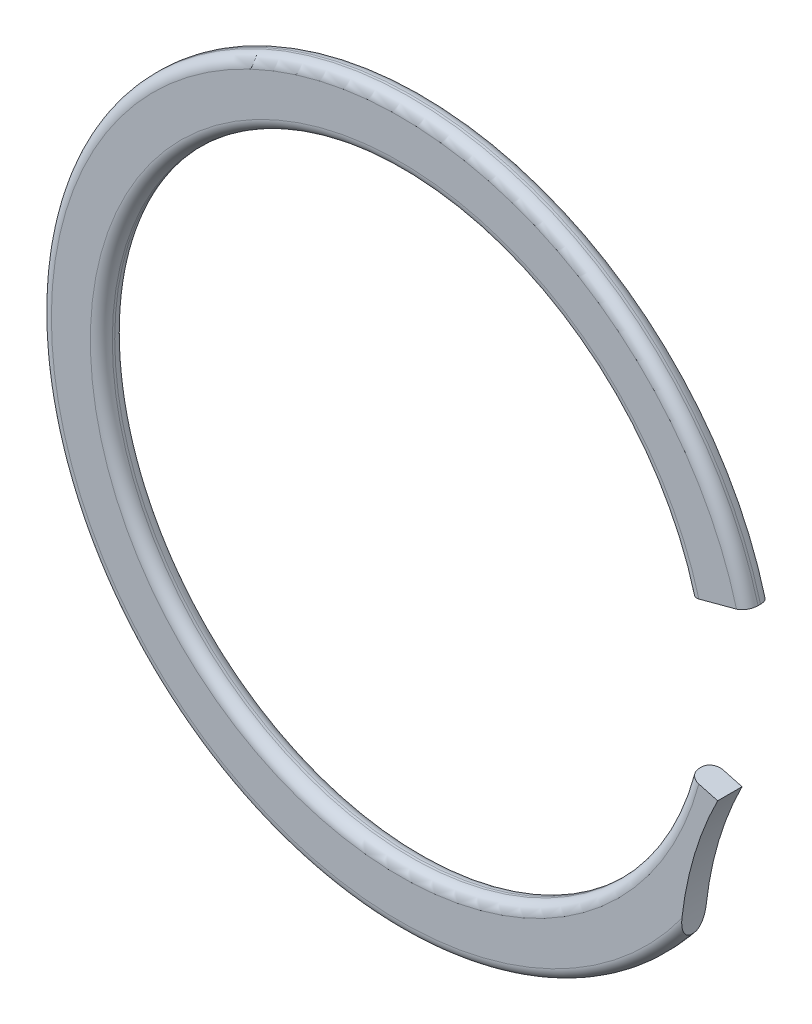
ISO-10303-21;
HEADER;
FILE_DESCRIPTION(('STEP AP214'),'2;1');
FILE_NAME('part.step','',(''),(''),'','','');
FILE_SCHEMA(('AUTOMOTIVE_DESIGN { 1 0 10303 214 1 1 1 1 }'));
ENDSEC;
DATA;
#1=APPLICATION_CONTEXT('core data for automotive mechanical design processes');
#2=APPLICATION_PROTOCOL_DEFINITION('international standard','automotive_design',2000,#1);
#3=PRODUCT_CONTEXT('',#1,'mechanical');
#4=PRODUCT('Part','Part','',(#3));
#5=PRODUCT_RELATED_PRODUCT_CATEGORY('part','',(#4));
#6=PRODUCT_DEFINITION_FORMATION('','',#4);
#7=PRODUCT_DEFINITION_CONTEXT('part definition',#1,'design');
#8=PRODUCT_DEFINITION('design','',#6,#7);
#9=PRODUCT_DEFINITION_SHAPE('','',#8);
#10=(LENGTH_UNIT() NAMED_UNIT(*) SI_UNIT(.MILLI.,.METRE.));
#11=(NAMED_UNIT(*) PLANE_ANGLE_UNIT() SI_UNIT($,.RADIAN.));
#12=(NAMED_UNIT(*) SI_UNIT($,.STERADIAN.) SOLID_ANGLE_UNIT());
#13=UNCERTAINTY_MEASURE_WITH_UNIT(LENGTH_MEASURE(1.E-05),#10,'distance_accuracy_value','');
#14=(GEOMETRIC_REPRESENTATION_CONTEXT(3) GLOBAL_UNCERTAINTY_ASSIGNED_CONTEXT((#13)) GLOBAL_UNIT_ASSIGNED_CONTEXT((#10,
#11,#12)) REPRESENTATION_CONTEXT('',''));
#15=CARTESIAN_POINT('',(0.,0.,0.));
#16=DIRECTION('',(0.,0.,1.));
#17=DIRECTION('',(1.,0.,0.));
#18=AXIS2_PLACEMENT_3D('',#15,#16,#17);
#19=CARTESIAN_POINT('',(0.,0.,0.2286));
#20=DIRECTION('',(0.,0.,-1.));
#21=DIRECTION('',(-1.,0.,0.));
#22=AXIS2_PLACEMENT_3D('',#19,#20,#21);
#23=CYLINDRICAL_SURFACE('',#22,5.6007);
#24=DIRECTION('',(0.,0.,-1.));
#25=VECTOR('',#24,1.);
#26=CARTESIAN_POINT('',(5.40986077529718,-1.44956782590569,0.2286));
#27=LINE('',#26,#25);
#28=CARTESIAN_POINT('',(5.40986077529718,-1.44956782590569,0.02286));
#29=VERTEX_POINT('',#28);
#30=CARTESIAN_POINT('',(5.40986077529718,-1.44956782590569,-0.02286));
#31=VERTEX_POINT('',#30);
#32=EDGE_CURVE('E134',#29,#31,#27,.T.);
#33=ORIENTED_EDGE('',*,*,#32,.T.);
#34=CARTESIAN_POINT('',(0.,0.,-0.02286));
#35=DIRECTION('',(0.,0.,1.));
#36=DIRECTION('',(1.,0.,0.));
#37=AXIS2_PLACEMENT_3D('',#34,#35,#36);
#38=CIRCLE('',#37,5.6007);
#39=CARTESIAN_POINT('',(5.40986077529718,1.44956782590569,-0.02286));
#40=VERTEX_POINT('',#39);
#41=EDGE_CURVE('E160',#31,#40,#38,.F.);
#42=ORIENTED_EDGE('',*,*,#41,.T.);
#43=DIRECTION('',(0.,0.,-1.));
#44=VECTOR('',#43,1.);
#45=CARTESIAN_POINT('',(5.40986077529718,1.44956782590569,0.2286));
#46=LINE('',#45,#44);
#47=CARTESIAN_POINT('',(5.40986077529718,1.44956782590569,0.02286));
#48=VERTEX_POINT('',#47);
#49=EDGE_CURVE('E155',#48,#40,#46,.T.);
#50=ORIENTED_EDGE('',*,*,#49,.F.);
#51=CARTESIAN_POINT('',(0.,0.,0.02286));
#52=DIRECTION('',(0.,0.,1.));
#53=DIRECTION('',(1.,0.,0.));
#54=AXIS2_PLACEMENT_3D('',#51,#52,#53);
#55=CIRCLE('',#54,5.6007);
#56=EDGE_CURVE('E158',#48,#29,#55,.T.);
#57=ORIENTED_EDGE('',*,*,#56,.T.);
#58=EDGE_LOOP('',(#33,#42,#50,#57));
#59=FACE_BOUND('',#58,.T.);
#60=ADVANCED_FACE('F37',(#59),#23,.F.);
#61=CARTESIAN_POINT('',(5.40986077529718,1.44956782590569,0.2286));
#62=DIRECTION('',(-0.258819045102522,0.965925826289068,0.));
#63=DIRECTION('',(-0.965925826289068,-0.258819045102522,0.));
#64=AXIS2_PLACEMENT_3D('',#61,#62,#63);
#65=PLANE('',#64);
#66=ORIENTED_EDGE('',*,*,#49,.T.);
#67=CARTESIAN_POINT('',(5.6085903547979,1.50281725624509,-0.02286));
#68=DIRECTION('',(-0.258819045102522,0.965925826289068,0.));
#69=DIRECTION('',(-0.965925826289068,-0.258819045102522,0.));
#70=AXIS2_PLACEMENT_3D('',#67,#68,#69);
#71=CIRCLE('',#70,0.20574);
#72=CARTESIAN_POINT('',(5.6085903547979,1.50281725624508,-0.2286));
#73=VERTEX_POINT('',#72);
#74=EDGE_CURVE('E169',#40,#73,#71,.F.);
#75=ORIENTED_EDGE('',*,*,#74,.T.);
#76=DIRECTION('',(0.965925826289068,0.258819045102522,0.));
#77=VECTOR('',#76,1.);
#78=CARTESIAN_POINT('',(5.40986077529718,1.44956782590569,-0.2286));
#79=LINE('',#78,#77);
#80=CARTESIAN_POINT('',(6.31518441524488,1.69214856411848,-0.2286));
#81=VERTEX_POINT('',#80);
#82=EDGE_CURVE('E145',#73,#81,#79,.T.);
#83=ORIENTED_EDGE('',*,*,#82,.T.);
#84=CARTESIAN_POINT('',(6.31518441524487,1.69214856411848,-0.02286));
#85=DIRECTION('',(-0.258819045102522,0.965925826289068,0.));
#86=DIRECTION('',(-0.965925826289068,-0.258819045102522,0.));
#87=AXIS2_PLACEMENT_3D('',#84,#85,#86);
#88=CIRCLE('',#87,0.20574);
#89=CARTESIAN_POINT('',(6.51391399474559,1.74539799445787,-0.02286));
#90=VERTEX_POINT('',#89);
#91=EDGE_CURVE('E165',#81,#90,#88,.F.);
#92=ORIENTED_EDGE('',*,*,#91,.T.);
#93=DIRECTION('',(0.,0.,-1.));
#94=VECTOR('',#93,1.);
#95=CARTESIAN_POINT('',(6.51391399474559,1.74539799445787,0.2286));
#96=LINE('',#95,#94);
#97=CARTESIAN_POINT('',(6.51391399474559,1.74539799445787,0.02286));
#98=VERTEX_POINT('',#97);
#99=EDGE_CURVE('E152',#98,#90,#96,.T.);
#100=ORIENTED_EDGE('',*,*,#99,.F.);
#101=CARTESIAN_POINT('',(6.31518441524487,1.69214856411848,0.02286));
#102=DIRECTION('',(-0.258819045102522,0.965925826289068,0.));
#103=DIRECTION('',(-0.965925826289068,-0.258819045102522,0.));
#104=AXIS2_PLACEMENT_3D('',#101,#102,#103);
#105=CIRCLE('',#104,0.20574);
#106=CARTESIAN_POINT('',(6.31518441524488,1.69214856411848,0.2286));
#107=VERTEX_POINT('',#106);
#108=EDGE_CURVE('E163',#98,#107,#105,.F.);
#109=ORIENTED_EDGE('',*,*,#108,.T.);
#110=DIRECTION('',(0.965925826289068,0.258819045102522,0.));
#111=VECTOR('',#110,1.);
#112=CARTESIAN_POINT('',(5.40986077529718,1.44956782590569,0.2286));
#113=LINE('',#112,#111);
#114=CARTESIAN_POINT('',(5.6085903547979,1.50281725624508,0.2286));
#115=VERTEX_POINT('',#114);
#116=EDGE_CURVE('E123',#115,#107,#113,.T.);
#117=ORIENTED_EDGE('',*,*,#116,.F.);
#118=CARTESIAN_POINT('',(5.6085903547979,1.50281725624509,0.02286));
#119=DIRECTION('',(-0.258819045102522,0.965925826289068,0.));
#120=DIRECTION('',(-0.965925826289068,-0.258819045102522,0.));
#121=AXIS2_PLACEMENT_3D('',#118,#119,#120);
#122=CIRCLE('',#121,0.20574);
#123=EDGE_CURVE('E167',#115,#48,#122,.F.);
#124=ORIENTED_EDGE('',*,*,#123,.T.);
#125=EDGE_LOOP('',(#66,#75,#83,#92,#100,#109,#117,#124));
#126=FACE_BOUND('',#125,.T.);
#127=ADVANCED_FACE('F197',(#126),#65,.F.);
#128=CARTESIAN_POINT('',(0.,0.,0.2286));
#129=DIRECTION('',(0.,0.,-1.));
#130=DIRECTION('',(-1.,0.,0.));
#131=AXIS2_PLACEMENT_3D('',#128,#129,#130);
#132=CYLINDRICAL_SURFACE('',#131,6.7437);
#133=ORIENTED_EDGE('',*,*,#99,.T.);
#134=CARTESIAN_POINT('',(0.,0.,-0.02286));
#135=DIRECTION('',(0.,0.,1.));
#136=DIRECTION('',(1.,0.,0.));
#137=AXIS2_PLACEMENT_3D('',#134,#135,#136);
#138=CIRCLE('',#137,6.7437);
#139=CARTESIAN_POINT('',(5.25870710178336,-4.22178745410677,-0.02286));
#140=VERTEX_POINT('',#139);
#141=EDGE_CURVE('E183',#90,#140,#138,.T.);
#142=ORIENTED_EDGE('',*,*,#141,.T.);
#143=DIRECTION('',(0.,0.,-1.));
#144=VECTOR('',#143,1.);
#145=CARTESIAN_POINT('',(5.25870710178336,-4.22178745410677,0.2286));
#146=LINE('',#145,#144);
#147=CARTESIAN_POINT('',(5.25870710178336,-4.22178745410677,0.02286));
#148=VERTEX_POINT('',#147);
#149=EDGE_CURVE('E133',#148,#140,#146,.T.);
#150=ORIENTED_EDGE('',*,*,#149,.F.);
#151=CARTESIAN_POINT('',(0.,0.,0.02286));
#152=DIRECTION('',(0.,0.,1.));
#153=DIRECTION('',(1.,0.,0.));
#154=AXIS2_PLACEMENT_3D('',#151,#152,#153);
#155=CIRCLE('',#154,6.7437);
#156=EDGE_CURVE('E181',#148,#98,#155,.F.);
#157=ORIENTED_EDGE('',*,*,#156,.T.);
#158=EDGE_LOOP('',(#133,#142,#150,#157));
#159=FACE_BOUND('',#158,.T.);
#160=ADVANCED_FACE('F192',(#159),#132,.T.);
#161=CARTESIAN_POINT('',(11.8481979332859,-4.58107563446412,0.2286));
#162=DIRECTION('',(0.,0.,-1.));
#163=DIRECTION('',(-1.,0.,0.));
#164=AXIS2_PLACEMENT_3D('',#161,#162,#163);
#165=CYLINDRICAL_SURFACE('',#164,6.59927855261474);
#166=ORIENTED_EDGE('',*,*,#149,.T.);
#167=CARTESIAN_POINT('',(5.25870710178336,-4.22178745410677,-0.02286));
#168=CARTESIAN_POINT('',(5.25870618484912,-4.22181377440628,-0.0311346804732611));
#169=CARTESIAN_POINT('',(5.25875361373559,-4.22093385432323,-0.0393759772816312));
#170=CARTESIAN_POINT('',(5.25893628270641,-4.21760247096861,-0.0554344022414807));
#171=CARTESIAN_POINT('',(5.25907044912222,-4.21517022756176,-0.0632554668394935));
#172=CARTESIAN_POINT('',(5.25941727513635,-4.20897923960508,-0.0782947041500948));
#173=CARTESIAN_POINT('',(5.25962956958604,-4.20522666942315,-0.0855154929339836));
#174=CARTESIAN_POINT('',(5.26012354056371,-4.19666455570426,-0.0993167484833779));
#175=CARTESIAN_POINT('',(5.26040544065308,-4.19185161190302,-0.105895054779456));
#176=CARTESIAN_POINT('',(5.26119839347793,-4.17861039126786,-0.121729278597547));
#177=CARTESIAN_POINT('',(5.26175110839779,-4.16963072561344,-0.130520060605449));
#178=CARTESIAN_POINT('',(5.26297775608299,-4.15044094474612,-0.146605313635845));
#179=CARTESIAN_POINT('',(5.26365191916114,-4.14022850406845,-0.153896884318738));
#180=CARTESIAN_POINT('',(5.26559180669542,-4.11194375522221,-0.171592430486733));
#181=CARTESIAN_POINT('',(5.26695280686477,-4.09316047225724,-0.180842054025715));
#182=CARTESIAN_POINT('',(5.26993811858312,-4.05442713788926,-0.196512369633285));
#183=CARTESIAN_POINT('',(5.27156376283052,-4.03447152609617,-0.202918097853559));
#184=CARTESIAN_POINT('',(5.27576428741668,-3.98575541699964,-0.215543311421398));
#185=CARTESIAN_POINT('',(5.27845645902292,-3.95671220957192,-0.220629344297652));
#186=CARTESIAN_POINT('',(5.28278794787484,-3.9131839459249,-0.225515665971397));
#187=CARTESIAN_POINT('',(5.28426653409714,-3.8988057181605,-0.22668864776739));
#188=CARTESIAN_POINT('',(5.28732034988349,-3.87004054702135,-0.228228847491245));
#189=CARTESIAN_POINT('',(5.28889541073569,-3.85565366009843,-0.228597432971679));
#190=CARTESIAN_POINT('',(5.29051835660908,-3.84126756162576,-0.228600000009827));
#191=B_SPLINE_CURVE_WITH_KNOTS('',3,(#167,#168,#169,#170,#171,#172,#173,#174,#175,#176,#177,
#178,#179,#180,#181,#182,#183,#184,#185,#186,#187,#188,#189,#190),.UNSPECIFIED.,.F.,.F.,(4,2,2,
2,2,2,2,2,2,2,2,4),(0.,0.0247243751463407,0.0491484155819667,0.0734597252622984,
0.0978501582393234,0.13537172357385,0.172965208093986,0.235555997965558,0.298472330446135,
0.386955377023208,0.43044549825703,0.473861624236137),.UNSPECIFIED.);
#192=CARTESIAN_POINT('',(5.2905183566094,-3.84126756162324,-0.2286));
#193=VERTEX_POINT('',#192);
#194=EDGE_CURVE('E11',#140,#193,#191,.T.);
#195=ORIENTED_EDGE('',*,*,#194,.T.);
#196=CARTESIAN_POINT('',(11.8481979332859,-4.58107563446412,-0.2286));
#197=DIRECTION('',(0.,0.,-1.));
#198=DIRECTION('',(1.,0.,0.));
#199=AXIS2_PLACEMENT_3D('',#196,#197,#198);
#200=CIRCLE('',#199,6.59927855261474);
#201=CARTESIAN_POINT('',(5.96188738502138,-1.59748291018178,-0.2286));
#202=VERTEX_POINT('',#201);
#203=EDGE_CURVE('E129',#193,#202,#200,.T.);
#204=ORIENTED_EDGE('',*,*,#203,.T.);
#205=DIRECTION('',(0.,0.,-1.));
#206=VECTOR('',#205,1.);
#207=CARTESIAN_POINT('',(5.96188738502138,-1.59748291018178,0.2286));
#208=LINE('',#207,#206);
#209=CARTESIAN_POINT('',(5.96188738502138,-1.59748291018178,0.2286));
#210=VERTEX_POINT('',#209);
#211=EDGE_CURVE('E126',#210,#202,#208,.T.);
#212=ORIENTED_EDGE('',*,*,#211,.F.);
#213=CARTESIAN_POINT('',(11.8481979332859,-4.58107563446412,0.2286));
#214=DIRECTION('',(0.,0.,-1.));
#215=DIRECTION('',(1.,0.,0.));
#216=AXIS2_PLACEMENT_3D('',#213,#214,#215);
#217=CIRCLE('',#216,6.59927855261474);
#218=CARTESIAN_POINT('',(5.2905183566094,-3.84126756162324,0.2286));
#219=VERTEX_POINT('',#218);
#220=EDGE_CURVE('E113',#219,#210,#217,.T.);
#221=ORIENTED_EDGE('',*,*,#220,.F.);
#222=CARTESIAN_POINT('',(5.2905183566094,-3.84126756162324,0.2286));
#223=CARTESIAN_POINT('',(5.28858068143016,-3.85843842874321,0.228592672466069));
#224=CARTESIAN_POINT('',(5.28671039018272,-3.87562676262966,0.228069816018459));
#225=CARTESIAN_POINT('',(5.28310511847852,-3.91000797623636,0.225856331987943));
#226=CARTESIAN_POINT('',(5.28137068683543,-3.9272006185604,0.224161215111085));
#227=CARTESIAN_POINT('',(5.27803959153466,-3.96156173092725,0.21944590782354));
#228=CARTESIAN_POINT('',(5.27644412659451,-3.97872893324474,0.216415338584235));
#229=CARTESIAN_POINT('',(5.27341768380362,-4.01271657704711,0.208828911910879));
#230=CARTESIAN_POINT('',(5.27198641821535,-4.02953758138375,0.204275779145824));
#231=CARTESIAN_POINT('',(5.26964173614769,-4.0583632665669,0.194766942021903));
#232=CARTESIAN_POINT('',(5.26868964550739,-4.07049685497902,0.190213905622912));
#233=CARTESIAN_POINT('',(5.26688730171751,-4.09428034547199,0.179961762904873));
#234=CARTESIAN_POINT('',(5.26603700047403,-4.10593047426638,0.174263201265855));
#235=CARTESIAN_POINT('',(5.26443980081566,-4.12859757658371,0.161482558972795));
#236=CARTESIAN_POINT('',(5.26369384999356,-4.13960827552167,0.15438905120647));
#237=CARTESIAN_POINT('',(5.26232878107568,-4.16046498039599,0.138638376323013));
#238=CARTESIAN_POINT('',(5.26170940133258,-4.17031337086536,0.129984505989414));
#239=CARTESIAN_POINT('',(5.2608099259451,-4.18505670663943,0.114273563573802));
#240=CARTESIAN_POINT('',(5.26048693413885,-4.19047935703411,0.107716728632742));
#241=CARTESIAN_POINT('',(5.25991218433513,-4.20029693488472,0.093855295067759));
#242=CARTESIAN_POINT('',(5.25966043649585,-4.20469171576843,0.0865505900122581));
#243=CARTESIAN_POINT('',(5.25923628187348,-4.21219056479722,0.0711732419786442));
#244=CARTESIAN_POINT('',(5.25906495148464,-4.21527707145056,0.0630918340560122));
#245=CARTESIAN_POINT('',(5.25881819471666,-4.21974824764553,0.0464834525758514));
#246=CARTESIAN_POINT('',(5.25874238833521,-4.22113965967301,0.0379583858753324));
#247=CARTESIAN_POINT('',(5.25871030817721,-4.22172886212149,0.027220408252027));
#248=CARTESIAN_POINT('',(5.2587070538979,-4.22178868979613,0.0250396430635047));
#249=CARTESIAN_POINT('',(5.25870710178336,-4.22178745410677,0.0228600000000001));
#250=B_SPLINE_CURVE_WITH_KNOTS('',3,(#222,#223,#224,#225,#226,#227,#228,#229,#230,#231,#232,
#233,#234,#235,#236,#237,#238,#239,#240,#241,#242,#243,#244,#245,#246,#247,#248,#249),
.UNSPECIFIED.,.F.,.F.,(4,2,2,2,2,2,2,2,2,2,2,2,2,4),(0.,0.0518467962248723,0.103893252741262,
0.156351539335899,0.20871644833783,0.247652674759219,0.286570431196202,0.325821376397392,
0.364990342543509,0.390458801818303,0.415930890635279,0.441734832822795,0.46743579738377,
0.473977177215381),.UNSPECIFIED.);
#251=EDGE_CURVE('E51',#219,#148,#250,.T.);
#252=ORIENTED_EDGE('',*,*,#251,.T.);
#253=EDGE_LOOP('',(#166,#195,#204,#212,#221,#252));
#254=FACE_BOUND('',#253,.T.);
#255=ADVANCED_FACE('F127',(#254),#165,.F.);
#256=CARTESIAN_POINT('',(5.40986077529718,-1.44956782590569,0.2286));
#257=DIRECTION('',(-0.258819045102523,-0.965925826289068,0.));
#258=DIRECTION('',(0.965925826289068,-0.258819045102524,0.));
#259=AXIS2_PLACEMENT_3D('',#256,#257,#258);
#260=PLANE('',#259);
#261=DIRECTION('',(-0.965925826289068,0.258819045102523,0.));
#262=VECTOR('',#261,1.);
#263=CARTESIAN_POINT('',(5.40986077529718,-1.44956782590569,-0.2286));
#264=LINE('',#263,#262);
#265=CARTESIAN_POINT('',(5.6085903547979,-1.50281725624508,-0.2286));
#266=VERTEX_POINT('',#265);
#267=EDGE_CURVE('E149',#202,#266,#264,.T.);
#268=ORIENTED_EDGE('',*,*,#267,.T.);
#269=CARTESIAN_POINT('',(5.6085903547979,-1.5028172562451,-0.02286));
#270=DIRECTION('',(-0.258819045102523,-0.965925826289068,0.));
#271=DIRECTION('',(0.965925826289068,-0.258819045102524,0.));
#272=AXIS2_PLACEMENT_3D('',#269,#270,#271);
#273=CIRCLE('',#272,0.20574);
#274=EDGE_CURVE('E176',#266,#31,#273,.F.);
#275=ORIENTED_EDGE('',*,*,#274,.T.);
#276=ORIENTED_EDGE('',*,*,#32,.F.);
#277=CARTESIAN_POINT('',(5.6085903547979,-1.5028172562451,0.02286));
#278=DIRECTION('',(-0.258819045102523,-0.965925826289068,0.));
#279=DIRECTION('',(0.965925826289068,-0.258819045102524,0.));
#280=AXIS2_PLACEMENT_3D('',#277,#278,#279);
#281=CIRCLE('',#280,0.20574);
#282=CARTESIAN_POINT('',(5.6085903547979,-1.50281725624508,0.2286));
#283=VERTEX_POINT('',#282);
#284=EDGE_CURVE('E139',#29,#283,#281,.F.);
#285=ORIENTED_EDGE('',*,*,#284,.T.);
#286=DIRECTION('',(-0.965925826289068,0.258819045102523,0.));
#287=VECTOR('',#286,1.);
#288=CARTESIAN_POINT('',(5.40986077529718,-1.44956782590569,0.2286));
#289=LINE('',#288,#287);
#290=EDGE_CURVE('E118',#210,#283,#289,.T.);
#291=ORIENTED_EDGE('',*,*,#290,.F.);
#292=ORIENTED_EDGE('',*,*,#211,.T.);
#293=EDGE_LOOP('',(#268,#275,#276,#285,#291,#292));
#294=FACE_BOUND('',#293,.T.);
#295=ADVANCED_FACE('F136',(#294),#260,.F.);
#296=CARTESIAN_POINT('',(0.,0.,0.2286));
#297=DIRECTION('',(0.,0.,1.));
#298=DIRECTION('',(1.,0.,0.));
#299=AXIS2_PLACEMENT_3D('',#296,#297,#298);
#300=PLANE('',#299);
#301=ORIENTED_EDGE('',*,*,#290,.T.);
#302=CARTESIAN_POINT('',(0.,0.,0.2286));
#303=DIRECTION('',(0.,0.,1.));
#304=DIRECTION('',(1.,0.,0.));
#305=AXIS2_PLACEMENT_3D('',#302,#303,#304);
#306=CIRCLE('',#305,5.80644);
#307=EDGE_CURVE('E179',#283,#115,#306,.F.);
#308=ORIENTED_EDGE('',*,*,#307,.T.);
#309=ORIENTED_EDGE('',*,*,#116,.T.);
#310=CARTESIAN_POINT('',(0.,0.,0.2286));
#311=DIRECTION('',(0.,0.,1.));
#312=DIRECTION('',(1.,0.,0.));
#313=AXIS2_PLACEMENT_3D('',#310,#311,#312);
#314=CIRCLE('',#313,6.53796);
#315=EDGE_CURVE('E122',#107,#219,#314,.T.);
#316=ORIENTED_EDGE('',*,*,#315,.T.);
#317=ORIENTED_EDGE('',*,*,#220,.T.);
#318=EDGE_LOOP('',(#301,#308,#309,#316,#317));
#319=FACE_BOUND('',#318,.T.);
#320=ADVANCED_FACE('F115',(#319),#300,.T.);
#321=CARTESIAN_POINT('',(0.,0.,-0.2286));
#322=DIRECTION('',(0.,0.,1.));
#323=DIRECTION('',(1.,0.,0.));
#324=AXIS2_PLACEMENT_3D('',#321,#322,#323);
#325=PLANE('',#324);
#326=ORIENTED_EDGE('',*,*,#82,.F.);
#327=CARTESIAN_POINT('',(0.,0.,-0.2286));
#328=DIRECTION('',(0.,0.,1.));
#329=DIRECTION('',(1.,0.,0.));
#330=AXIS2_PLACEMENT_3D('',#327,#328,#329);
#331=CIRCLE('',#330,5.80644);
#332=EDGE_CURVE('E173',#73,#266,#331,.T.);
#333=ORIENTED_EDGE('',*,*,#332,.T.);
#334=ORIENTED_EDGE('',*,*,#267,.F.);
#335=ORIENTED_EDGE('',*,*,#203,.F.);
#336=CARTESIAN_POINT('',(0.,0.,-0.2286));
#337=DIRECTION('',(0.,0.,1.));
#338=DIRECTION('',(1.,0.,0.));
#339=AXIS2_PLACEMENT_3D('',#336,#337,#338);
#340=CIRCLE('',#339,6.53796);
#341=EDGE_CURVE('E171',#193,#81,#340,.F.);
#342=ORIENTED_EDGE('',*,*,#341,.T.);
#343=EDGE_LOOP('',(#326,#333,#334,#335,#342));
#344=FACE_BOUND('',#343,.T.);
#345=ADVANCED_FACE('F209',(#344),#325,.F.);
#346=CARTESIAN_POINT('',(0.,0.,-0.02286));
#347=DIRECTION('',(0.,0.,1.));
#348=DIRECTION('',(1.,0.,0.));
#349=AXIS2_PLACEMENT_3D('',#346,#347,#348);
#350=TOROIDAL_SURFACE('',#349,5.80644,0.20574);
#351=ORIENTED_EDGE('',*,*,#274,.F.);
#352=ORIENTED_EDGE('',*,*,#332,.F.);
#353=ORIENTED_EDGE('',*,*,#74,.F.);
#354=ORIENTED_EDGE('',*,*,#41,.F.);
#355=EDGE_LOOP('',(#351,#352,#353,#354));
#356=FACE_BOUND('',#355,.T.);
#357=ADVANCED_FACE('F205',(#356),#350,.T.);
#358=CARTESIAN_POINT('',(0.,0.,0.02286));
#359=DIRECTION('',(0.,0.,1.));
#360=DIRECTION('',(1.,0.,0.));
#361=AXIS2_PLACEMENT_3D('',#358,#359,#360);
#362=TOROIDAL_SURFACE('',#361,5.80644,0.20574);
#363=ORIENTED_EDGE('',*,*,#284,.F.);
#364=ORIENTED_EDGE('',*,*,#56,.F.);
#365=ORIENTED_EDGE('',*,*,#123,.F.);
#366=ORIENTED_EDGE('',*,*,#307,.F.);
#367=EDGE_LOOP('',(#363,#364,#365,#366));
#368=FACE_BOUND('',#367,.T.);
#369=ADVANCED_FACE('F208',(#368),#362,.T.);
#370=CARTESIAN_POINT('',(0.,0.,-0.02286));
#371=DIRECTION('',(0.,0.,1.));
#372=DIRECTION('',(1.,0.,0.));
#373=AXIS2_PLACEMENT_3D('',#370,#371,#372);
#374=TOROIDAL_SURFACE('',#373,6.53796,0.20574);
#375=ORIENTED_EDGE('',*,*,#91,.F.);
#376=ORIENTED_EDGE('',*,*,#341,.F.);
#377=ORIENTED_EDGE('',*,*,#194,.F.);
#378=ORIENTED_EDGE('',*,*,#141,.F.);
#379=EDGE_LOOP('',(#375,#376,#377,#378));
#380=FACE_BOUND('',#379,.T.);
#381=ADVANCED_FACE('F212',(#380),#374,.T.);
#382=CARTESIAN_POINT('',(0.,0.,0.02286));
#383=DIRECTION('',(0.,0.,1.));
#384=DIRECTION('',(1.,0.,0.));
#385=AXIS2_PLACEMENT_3D('',#382,#383,#384);
#386=TOROIDAL_SURFACE('',#385,6.53796,0.20574);
#387=ORIENTED_EDGE('',*,*,#108,.F.);
#388=ORIENTED_EDGE('',*,*,#156,.F.);
#389=ORIENTED_EDGE('',*,*,#251,.F.);
#390=ORIENTED_EDGE('',*,*,#315,.F.);
#391=EDGE_LOOP('',(#387,#388,#389,#390));
#392=FACE_BOUND('',#391,.T.);
#393=ADVANCED_FACE('F39',(#392),#386,.T.);
#394=CLOSED_SHELL('',(#60,#127,#160,#255,#295,#320,#345,#357,#369,#381,#393));
#395=MANIFOLD_SOLID_BREP('B2',#394);
#396=ADVANCED_BREP_SHAPE_REPRESENTATION('',(#18,#395),#14);
#397=SHAPE_DEFINITION_REPRESENTATION(#9,#396);
ENDSEC;
END-ISO-10303-21;
